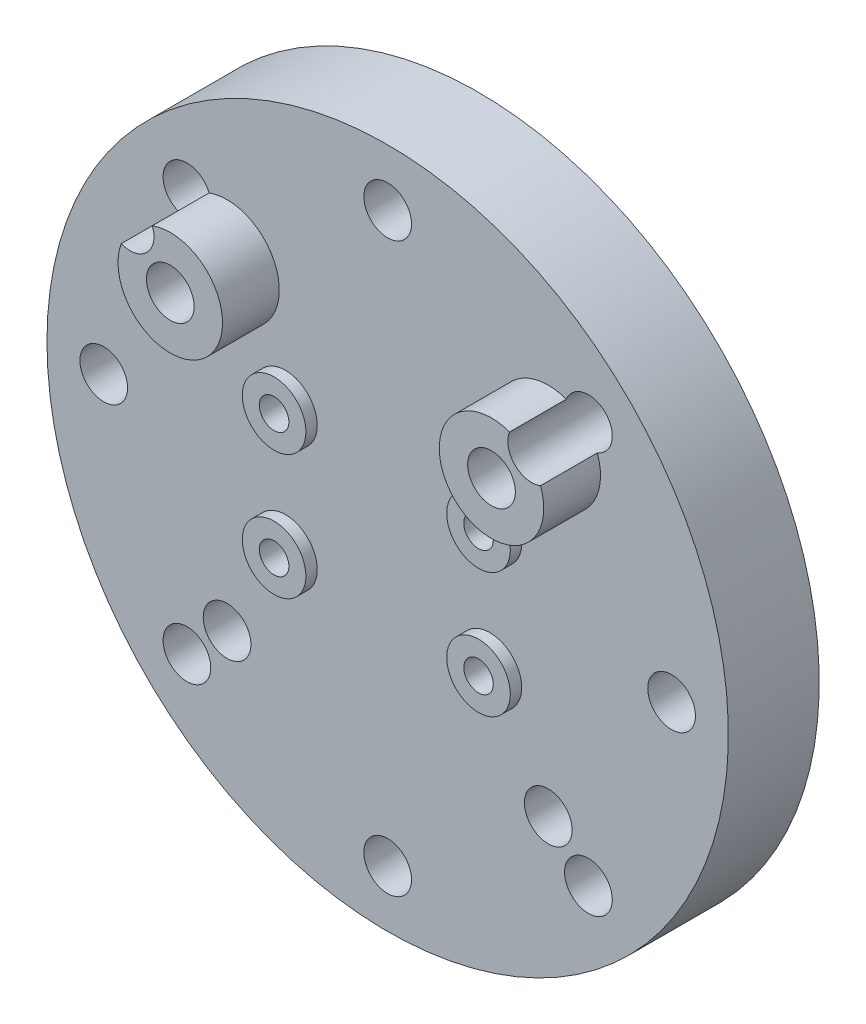
ISO-10303-21;
HEADER;
FILE_DESCRIPTION(('STEP AP214'),'2;1');
FILE_NAME('part.step','',(''),(''),'','','');
FILE_SCHEMA(('AUTOMOTIVE_DESIGN { 1 0 10303 214 1 1 1 1 }'));
ENDSEC;
DATA;
#1=APPLICATION_CONTEXT('core data for automotive mechanical design processes');
#2=APPLICATION_PROTOCOL_DEFINITION('international standard','automotive_design',2000,#1);
#3=PRODUCT_CONTEXT('',#1,'mechanical');
#4=PRODUCT('Part','Part','',(#3));
#5=PRODUCT_RELATED_PRODUCT_CATEGORY('part','',(#4));
#6=PRODUCT_DEFINITION_FORMATION('','',#4);
#7=PRODUCT_DEFINITION_CONTEXT('part definition',#1,'design');
#8=PRODUCT_DEFINITION('design','',#6,#7);
#9=PRODUCT_DEFINITION_SHAPE('','',#8);
#10=(LENGTH_UNIT() NAMED_UNIT(*) SI_UNIT(.MILLI.,.METRE.));
#11=(NAMED_UNIT(*) PLANE_ANGLE_UNIT() SI_UNIT($,.RADIAN.));
#12=(NAMED_UNIT(*) SI_UNIT($,.STERADIAN.) SOLID_ANGLE_UNIT());
#13=UNCERTAINTY_MEASURE_WITH_UNIT(LENGTH_MEASURE(1.E-05),#10,'distance_accuracy_value','');
#14=(GEOMETRIC_REPRESENTATION_CONTEXT(3) GLOBAL_UNCERTAINTY_ASSIGNED_CONTEXT((#13)) GLOBAL_UNIT_ASSIGNED_CONTEXT((#10,
#11,#12)) REPRESENTATION_CONTEXT('',''));
#15=CARTESIAN_POINT('',(0.,0.,0.));
#16=DIRECTION('',(0.,0.,1.));
#17=DIRECTION('',(1.,0.,0.));
#18=AXIS2_PLACEMENT_3D('',#15,#16,#17);
#19=CARTESIAN_POINT('',(-14.1421356237309,14.142135623731,2.));
#20=DIRECTION('',(0.,0.,-1.));
#21=DIRECTION('',(-1.,0.,0.));
#22=AXIS2_PLACEMENT_3D('',#19,#20,#21);
#23=CYLINDRICAL_SURFACE('',#22,2.1);
#24=CARTESIAN_POINT('',(-14.1421356237309,14.142135623731,7.));
#25=DIRECTION('',(0.,0.,1.));
#26=DIRECTION('',(1.,0.,0.));
#27=AXIS2_PLACEMENT_3D('',#24,#25,#26);
#28=CIRCLE('',#27,2.1);
#29=CARTESIAN_POINT('',(-12.0421356237309,14.142135623731,7.));
#30=VERTEX_POINT('',#29);
#31=EDGE_CURVE('E227',#30,#30,#28,.T.);
#32=ORIENTED_EDGE('',*,*,#31,.T.);
#33=EDGE_LOOP('',(#32));
#34=FACE_BOUND('',#33,.T.);
#35=CARTESIAN_POINT('',(-14.1421356237309,14.142135623731,-3.));
#36=DIRECTION('',(0.,0.,-1.));
#37=DIRECTION('',(-1.,0.,0.));
#38=AXIS2_PLACEMENT_3D('',#35,#36,#37);
#39=CIRCLE('',#38,2.1);
#40=CARTESIAN_POINT('',(-16.2421356237309,14.142135623731,-3.));
#41=VERTEX_POINT('',#40);
#42=EDGE_CURVE('E310',#41,#41,#39,.T.);
#43=ORIENTED_EDGE('',*,*,#42,.T.);
#44=EDGE_LOOP('',(#43));
#45=FACE_BOUND('',#44,.T.);
#46=ADVANCED_FACE('F34',(#34,#45),#23,.F.);
#47=CARTESIAN_POINT('',(14.142135623731,14.142135623731,2.));
#48=DIRECTION('',(0.,0.,-1.));
#49=DIRECTION('',(-1.,0.,0.));
#50=AXIS2_PLACEMENT_3D('',#47,#48,#49);
#51=CYLINDRICAL_SURFACE('',#50,2.1);
#52=CARTESIAN_POINT('',(14.142135623731,14.142135623731,7.));
#53=DIRECTION('',(0.,0.,1.));
#54=DIRECTION('',(1.,0.,0.));
#55=AXIS2_PLACEMENT_3D('',#52,#53,#54);
#56=CIRCLE('',#55,2.1);
#57=CARTESIAN_POINT('',(16.242135623731,14.142135623731,7.));
#58=VERTEX_POINT('',#57);
#59=EDGE_CURVE('E233',#58,#58,#56,.T.);
#60=ORIENTED_EDGE('',*,*,#59,.T.);
#61=EDGE_LOOP('',(#60));
#62=FACE_BOUND('',#61,.T.);
#63=CARTESIAN_POINT('',(14.142135623731,14.142135623731,-3.));
#64=DIRECTION('',(0.,0.,-1.));
#65=DIRECTION('',(-1.,0.,0.));
#66=AXIS2_PLACEMENT_3D('',#63,#64,#65);
#67=CIRCLE('',#66,2.1);
#68=CARTESIAN_POINT('',(12.042135623731,14.142135623731,-3.));
#69=VERTEX_POINT('',#68);
#70=EDGE_CURVE('E135',#69,#69,#67,.T.);
#71=ORIENTED_EDGE('',*,*,#70,.T.);
#72=EDGE_LOOP('',(#71));
#73=FACE_BOUND('',#72,.T.);
#74=ADVANCED_FACE('F377',(#62,#73),#51,.F.);
#75=CARTESIAN_POINT('',(-14.142135623731,-14.1421356237309,7.));
#76=DIRECTION('',(0.,0.,-1.));
#77=DIRECTION('',(-1.,0.,0.));
#78=AXIS2_PLACEMENT_3D('',#75,#76,#77);
#79=CYLINDRICAL_SURFACE('',#78,2.1);
#80=CARTESIAN_POINT('',(-14.142135623731,-14.1421356237309,2.));
#81=DIRECTION('',(0.,0.,1.));
#82=DIRECTION('',(1.,0.,0.));
#83=AXIS2_PLACEMENT_3D('',#80,#81,#82);
#84=CIRCLE('',#83,2.1);
#85=CARTESIAN_POINT('',(-12.042135623731,-14.1421356237309,2.));
#86=VERTEX_POINT('',#85);
#87=EDGE_CURVE('E183',#86,#86,#84,.T.);
#88=ORIENTED_EDGE('',*,*,#87,.T.);
#89=EDGE_LOOP('',(#88));
#90=FACE_BOUND('',#89,.T.);
#91=CARTESIAN_POINT('',(-14.142135623731,-14.1421356237309,-3.));
#92=DIRECTION('',(0.,0.,-1.));
#93=DIRECTION('',(-1.,0.,0.));
#94=AXIS2_PLACEMENT_3D('',#91,#92,#93);
#95=CIRCLE('',#94,2.1);
#96=CARTESIAN_POINT('',(-16.242135623731,-14.1421356237309,-3.));
#97=VERTEX_POINT('',#96);
#98=EDGE_CURVE('E312',#97,#97,#95,.T.);
#99=ORIENTED_EDGE('',*,*,#98,.T.);
#100=EDGE_LOOP('',(#99));
#101=FACE_BOUND('',#100,.T.);
#102=ADVANCED_FACE('F383',(#90,#101),#79,.F.);
#103=CARTESIAN_POINT('',(14.142135623731,-14.1421356237309,7.));
#104=DIRECTION('',(0.,0.,-1.));
#105=DIRECTION('',(-1.,0.,0.));
#106=AXIS2_PLACEMENT_3D('',#103,#104,#105);
#107=CYLINDRICAL_SURFACE('',#106,2.1);
#108=CARTESIAN_POINT('',(14.142135623731,-14.1421356237309,2.));
#109=DIRECTION('',(0.,0.,1.));
#110=DIRECTION('',(1.,0.,0.));
#111=AXIS2_PLACEMENT_3D('',#108,#109,#110);
#112=CIRCLE('',#111,2.1);
#113=CARTESIAN_POINT('',(16.242135623731,-14.1421356237309,2.));
#114=VERTEX_POINT('',#113);
#115=EDGE_CURVE('E206',#114,#114,#112,.T.);
#116=ORIENTED_EDGE('',*,*,#115,.T.);
#117=EDGE_LOOP('',(#116));
#118=FACE_BOUND('',#117,.T.);
#119=CARTESIAN_POINT('',(14.142135623731,-14.1421356237309,-3.));
#120=DIRECTION('',(0.,0.,-1.));
#121=DIRECTION('',(-1.,0.,0.));
#122=AXIS2_PLACEMENT_3D('',#119,#120,#121);
#123=CIRCLE('',#122,2.1);
#124=CARTESIAN_POINT('',(12.042135623731,-14.1421356237309,-3.));
#125=VERTEX_POINT('',#124);
#126=EDGE_CURVE('E320',#125,#125,#123,.T.);
#127=ORIENTED_EDGE('',*,*,#126,.T.);
#128=EDGE_LOOP('',(#127));
#129=FACE_BOUND('',#128,.T.);
#130=ADVANCED_FACE('F435',(#118,#129),#107,.F.);
#131=CARTESIAN_POINT('',(-14.1421356237309,14.142135623731,3.));
#132=DIRECTION('',(0.,0.,-1.));
#133=DIRECTION('',(-1.,0.,0.));
#134=AXIS2_PLACEMENT_3D('',#131,#132,#133);
#135=CYLINDRICAL_SURFACE('',#134,4.6);
#136=CARTESIAN_POINT('',(-14.1421356237309,14.142135623731,2.));
#137=DIRECTION('',(0.,0.,1.));
#138=DIRECTION('',(1.,0.,0.));
#139=AXIS2_PLACEMENT_3D('',#136,#137,#138);
#140=CIRCLE('',#139,4.6);
#141=CARTESIAN_POINT('',(-18.4598420443869,15.7287708259832,2.));
#142=VERTEX_POINT('',#141);
#143=CARTESIAN_POINT('',(-15.7287708259821,18.4598420443873,2.));
#144=VERTEX_POINT('',#143);
#145=EDGE_CURVE('E242',#142,#144,#140,.T.);
#146=ORIENTED_EDGE('',*,*,#145,.T.);
#147=DIRECTION('',(0.,0.,-1.));
#148=VECTOR('',#147,1.);
#149=CARTESIAN_POINT('',(-15.7287708259821,18.4598420443873,0.5));
#150=LINE('',#149,#148);
#151=CARTESIAN_POINT('',(-15.7287708259821,18.4598420443873,7.));
#152=VERTEX_POINT('',#151);
#153=EDGE_CURVE('E177',#144,#152,#150,.F.);
#154=ORIENTED_EDGE('',*,*,#153,.T.);
#155=CARTESIAN_POINT('',(-14.1421356237309,14.142135623731,7.));
#156=DIRECTION('',(0.,0.,1.));
#157=DIRECTION('',(1.,0.,0.));
#158=AXIS2_PLACEMENT_3D('',#155,#156,#157);
#159=CIRCLE('',#158,4.6);
#160=CARTESIAN_POINT('',(-18.4598420443869,15.7287708259832,7.));
#161=VERTEX_POINT('',#160);
#162=EDGE_CURVE('E230',#161,#152,#159,.T.);
#163=ORIENTED_EDGE('',*,*,#162,.F.);
#164=DIRECTION('',(0.,0.,-1.));
#165=VECTOR('',#164,1.);
#166=CARTESIAN_POINT('',(-18.4598420443869,15.7287708259832,0.5));
#167=LINE('',#166,#165);
#168=EDGE_CURVE('E174',#161,#142,#167,.T.);
#169=ORIENTED_EDGE('',*,*,#168,.T.);
#170=EDGE_LOOP('',(#146,#154,#163,#169));
#171=FACE_BOUND('',#170,.T.);
#172=ADVANCED_FACE('F430',(#171),#135,.T.);
#173=CARTESIAN_POINT('',(14.142135623731,14.142135623731,3.));
#174=DIRECTION('',(0.,0.,-1.));
#175=DIRECTION('',(-1.,0.,0.));
#176=AXIS2_PLACEMENT_3D('',#173,#174,#175);
#177=CYLINDRICAL_SURFACE('',#176,4.6);
#178=CARTESIAN_POINT('',(14.142135623731,14.142135623731,2.));
#179=DIRECTION('',(0.,0.,1.));
#180=DIRECTION('',(1.,0.,0.));
#181=AXIS2_PLACEMENT_3D('',#178,#179,#180);
#182=CIRCLE('',#181,4.6);
#183=CARTESIAN_POINT('',(15.728770825981,18.4598420443877,2.));
#184=VERTEX_POINT('',#183);
#185=CARTESIAN_POINT('',(18.4598420443881,15.72877082598,2.));
#186=VERTEX_POINT('',#185);
#187=EDGE_CURVE('E239',#184,#186,#182,.T.);
#188=ORIENTED_EDGE('',*,*,#187,.T.);
#189=DIRECTION('',(0.,0.,-1.));
#190=VECTOR('',#189,1.);
#191=CARTESIAN_POINT('',(18.4598420443881,15.72877082598,0.5));
#192=LINE('',#191,#190);
#193=CARTESIAN_POINT('',(18.4598420443881,15.72877082598,7.));
#194=VERTEX_POINT('',#193);
#195=EDGE_CURVE('E203',#186,#194,#192,.F.);
#196=ORIENTED_EDGE('',*,*,#195,.T.);
#197=CARTESIAN_POINT('',(14.142135623731,14.142135623731,7.));
#198=DIRECTION('',(0.,0.,1.));
#199=DIRECTION('',(1.,0.,0.));
#200=AXIS2_PLACEMENT_3D('',#197,#198,#199);
#201=CIRCLE('',#200,4.6);
#202=CARTESIAN_POINT('',(15.728770825981,18.4598420443877,7.));
#203=VERTEX_POINT('',#202);
#204=EDGE_CURVE('E236',#203,#194,#201,.T.);
#205=ORIENTED_EDGE('',*,*,#204,.F.);
#206=DIRECTION('',(0.,0.,-1.));
#207=VECTOR('',#206,1.);
#208=CARTESIAN_POINT('',(15.728770825981,18.4598420443877,0.5));
#209=LINE('',#208,#207);
#210=EDGE_CURVE('E200',#203,#184,#209,.T.);
#211=ORIENTED_EDGE('',*,*,#210,.T.);
#212=EDGE_LOOP('',(#188,#196,#205,#211));
#213=FACE_BOUND('',#212,.T.);
#214=ADVANCED_FACE('F434',(#213),#177,.T.);
#215=CARTESIAN_POINT('',(0.,0.,2.));
#216=DIRECTION('',(0.,0.,1.));
#217=DIRECTION('',(1.,0.,0.));
#218=AXIS2_PLACEMENT_3D('',#215,#216,#217);
#219=PLANE('',#218);
#220=CARTESIAN_POINT('',(17.6776695296631,17.6776695296622,2.));
#221=DIRECTION('',(0.,0.,1.));
#222=DIRECTION('',(1.,0.,0.));
#223=AXIS2_PLACEMENT_3D('',#220,#221,#222);
#224=CIRCLE('',#223,2.10000000000133);
#225=EDGE_CURVE('E198',#186,#184,#224,.T.);
#226=ORIENTED_EDGE('',*,*,#225,.F.);
#227=ORIENTED_EDGE('',*,*,#187,.F.);
#228=EDGE_LOOP('',(#226,#227));
#229=FACE_BOUND('',#228,.T.);
#230=CARTESIAN_POINT('',(24.9999999999979,-2.1316282072803E-12,2.));
#231=DIRECTION('',(0.,0.,1.));
#232=DIRECTION('',(1.,0.,0.));
#233=AXIS2_PLACEMENT_3D('',#230,#231,#232);
#234=CIRCLE('',#233,2.10000000000291);
#235=CARTESIAN_POINT('',(27.1000000000008,-2.1316282072803E-12,2.));
#236=VERTEX_POINT('',#235);
#237=EDGE_CURVE('E195',#236,#236,#234,.T.);
#238=ORIENTED_EDGE('',*,*,#237,.F.);
#239=EDGE_LOOP('',(#238));
#240=FACE_BOUND('',#239,.T.);
#241=CARTESIAN_POINT('',(17.6776695296601,-17.6776695296652,2.));
#242=DIRECTION('',(0.,0.,1.));
#243=DIRECTION('',(1.,0.,0.));
#244=AXIS2_PLACEMENT_3D('',#241,#242,#243);
#245=CIRCLE('',#244,2.10000000000413);
#246=CARTESIAN_POINT('',(19.7776695296642,-17.6776695296652,2.));
#247=VERTEX_POINT('',#246);
#248=EDGE_CURVE('E192',#247,#247,#245,.T.);
#249=ORIENTED_EDGE('',*,*,#248,.F.);
#250=EDGE_LOOP('',(#249));
#251=FACE_BOUND('',#250,.T.);
#252=CARTESIAN_POINT('',(-4.25713318056486E-12,-25.,2.));
#253=DIRECTION('',(0.,0.,1.));
#254=DIRECTION('',(1.,0.,0.));
#255=AXIS2_PLACEMENT_3D('',#252,#253,#254);
#256=CIRCLE('',#255,2.10000000000424);
#257=CARTESIAN_POINT('',(2.09999999999998,-25.,2.));
#258=VERTEX_POINT('',#257);
#259=EDGE_CURVE('E189',#258,#258,#256,.T.);
#260=ORIENTED_EDGE('',*,*,#259,.F.);
#261=EDGE_LOOP('',(#260));
#262=FACE_BOUND('',#261,.T.);
#263=CARTESIAN_POINT('',(-17.6776695296673,-17.6776695296622,2.));
#264=DIRECTION('',(0.,0.,1.));
#265=DIRECTION('',(1.,0.,0.));
#266=AXIS2_PLACEMENT_3D('',#263,#264,#265);
#267=CIRCLE('',#266,2.10000000000317);
#268=CARTESIAN_POINT('',(-15.5776695296642,-17.6776695296622,2.));
#269=VERTEX_POINT('',#268);
#270=EDGE_CURVE('E186',#269,#269,#267,.T.);
#271=ORIENTED_EDGE('',*,*,#270,.F.);
#272=EDGE_LOOP('',(#271));
#273=FACE_BOUND('',#272,.T.);
#274=ORIENTED_EDGE('',*,*,#87,.F.);
#275=EDGE_LOOP('',(#274));
#276=FACE_BOUND('',#275,.T.);
#277=CARTESIAN_POINT('',(0.,25.,2.));
#278=DIRECTION('',(0.,0.,1.));
#279=DIRECTION('',(1.,0.,0.));
#280=AXIS2_PLACEMENT_3D('',#277,#278,#279);
#281=CIRCLE('',#280,2.1);
#282=CARTESIAN_POINT('',(2.1,25.,2.));
#283=VERTEX_POINT('',#282);
#284=EDGE_CURVE('E180',#283,#283,#281,.T.);
#285=ORIENTED_EDGE('',*,*,#284,.F.);
#286=EDGE_LOOP('',(#285));
#287=FACE_BOUND('',#286,.T.);
#288=CARTESIAN_POINT('',(-17.6776695296643,17.6776695296652,2.));
#289=DIRECTION('',(0.,0.,1.));
#290=DIRECTION('',(1.,0.,0.));
#291=AXIS2_PLACEMENT_3D('',#288,#289,#290);
#292=CIRCLE('',#291,2.1000000000002);
#293=EDGE_CURVE('E172',#144,#142,#292,.T.);
#294=ORIENTED_EDGE('',*,*,#293,.F.);
#295=ORIENTED_EDGE('',*,*,#145,.F.);
#296=EDGE_LOOP('',(#294,#295));
#297=FACE_BOUND('',#296,.T.);
#298=CARTESIAN_POINT('',(-25.0000000000021,2.12856659028243E-12,2.));
#299=DIRECTION('',(0.,0.,1.));
#300=DIRECTION('',(1.,0.,0.));
#301=AXIS2_PLACEMENT_3D('',#298,#299,#300);
#302=CIRCLE('',#301,2.1000000000015);
#303=CARTESIAN_POINT('',(-22.9000000000006,2.12856659028243E-12,2.));
#304=VERTEX_POINT('',#303);
#305=EDGE_CURVE('E169',#304,#304,#302,.T.);
#306=ORIENTED_EDGE('',*,*,#305,.F.);
#307=EDGE_LOOP('',(#306));
#308=FACE_BOUND('',#307,.T.);
#309=ORIENTED_EDGE('',*,*,#115,.F.);
#310=EDGE_LOOP('',(#309));
#311=FACE_BOUND('',#310,.T.);
#312=CARTESIAN_POINT('',(-9.,5.5,2.));
#313=DIRECTION('',(0.,0.,1.));
#314=DIRECTION('',(1.,0.,0.));
#315=AXIS2_PLACEMENT_3D('',#312,#313,#314);
#316=CIRCLE('',#315,2.8);
#317=CARTESIAN_POINT('',(-6.2,5.5,2.));
#318=VERTEX_POINT('',#317);
#319=EDGE_CURVE('E248',#318,#318,#316,.T.);
#320=ORIENTED_EDGE('',*,*,#319,.F.);
#321=EDGE_LOOP('',(#320));
#322=FACE_BOUND('',#321,.T.);
#323=CARTESIAN_POINT('',(9.,-5.5,2.));
#324=DIRECTION('',(0.,0.,1.));
#325=DIRECTION('',(1.,0.,0.));
#326=AXIS2_PLACEMENT_3D('',#323,#324,#325);
#327=CIRCLE('',#326,2.8);
#328=CARTESIAN_POINT('',(11.8,-5.5,2.));
#329=VERTEX_POINT('',#328);
#330=EDGE_CURVE('E266',#329,#329,#327,.T.);
#331=ORIENTED_EDGE('',*,*,#330,.F.);
#332=EDGE_LOOP('',(#331));
#333=FACE_BOUND('',#332,.T.);
#334=CARTESIAN_POINT('',(-9.,-5.5,2.));
#335=DIRECTION('',(0.,0.,1.));
#336=DIRECTION('',(1.,0.,0.));
#337=AXIS2_PLACEMENT_3D('',#334,#335,#336);
#338=CIRCLE('',#337,2.8);
#339=CARTESIAN_POINT('',(-6.2,-5.5,2.));
#340=VERTEX_POINT('',#339);
#341=EDGE_CURVE('E275',#340,#340,#338,.T.);
#342=ORIENTED_EDGE('',*,*,#341,.F.);
#343=EDGE_LOOP('',(#342));
#344=FACE_BOUND('',#343,.T.);
#345=CARTESIAN_POINT('',(9.,5.5,2.));
#346=DIRECTION('',(0.,0.,1.));
#347=DIRECTION('',(1.,0.,0.));
#348=AXIS2_PLACEMENT_3D('',#345,#346,#347);
#349=CIRCLE('',#348,2.8);
#350=CARTESIAN_POINT('',(11.8,5.5,2.));
#351=VERTEX_POINT('',#350);
#352=EDGE_CURVE('E257',#351,#351,#349,.T.);
#353=ORIENTED_EDGE('',*,*,#352,.F.);
#354=EDGE_LOOP('',(#353));
#355=FACE_BOUND('',#354,.T.);
#356=CARTESIAN_POINT('',(0.,0.,2.));
#357=DIRECTION('',(0.,0.,-1.));
#358=DIRECTION('',(-1.,0.,0.));
#359=AXIS2_PLACEMENT_3D('',#356,#357,#358);
#360=CIRCLE('',#359,30.);
#361=CARTESIAN_POINT('',(-30.,0.,2.));
#362=VERTEX_POINT('',#361);
#363=EDGE_CURVE('E209',#362,#362,#360,.T.);
#364=ORIENTED_EDGE('',*,*,#363,.F.);
#365=EDGE_LOOP('',(#364));
#366=FACE_BOUND('',#365,.T.);
#367=ADVANCED_FACE('F36',(#229,#240,#251,#262,#273,#276,#287,#297,#308,#311,#322,#333,#344,#355,
#366),#219,.T.);
#368=CARTESIAN_POINT('',(-9.,5.5,2.));
#369=DIRECTION('',(0.,0.,-1.));
#370=DIRECTION('',(-1.,0.,0.));
#371=AXIS2_PLACEMENT_3D('',#368,#369,#370);
#372=CYLINDRICAL_SURFACE('',#371,1.3);
#373=CARTESIAN_POINT('',(-9.,5.5,3.));
#374=DIRECTION('',(0.,0.,1.));
#375=DIRECTION('',(1.,0.,0.));
#376=AXIS2_PLACEMENT_3D('',#373,#374,#375);
#377=CIRCLE('',#376,1.3);
#378=CARTESIAN_POINT('',(-7.7,5.5,3.));
#379=VERTEX_POINT('',#378);
#380=EDGE_CURVE('E245',#379,#379,#377,.T.);
#381=ORIENTED_EDGE('',*,*,#380,.T.);
#382=EDGE_LOOP('',(#381));
#383=FACE_BOUND('',#382,.T.);
#384=CARTESIAN_POINT('',(-9.,5.5,-6.));
#385=DIRECTION('',(0.,0.,-1.));
#386=DIRECTION('',(-1.,0.,0.));
#387=AXIS2_PLACEMENT_3D('',#384,#385,#386);
#388=CIRCLE('',#387,1.3);
#389=CARTESIAN_POINT('',(-10.3,5.5,-6.));
#390=VERTEX_POINT('',#389);
#391=EDGE_CURVE('E221',#390,#390,#388,.T.);
#392=ORIENTED_EDGE('',*,*,#391,.T.);
#393=EDGE_LOOP('',(#392));
#394=FACE_BOUND('',#393,.T.);
#395=ADVANCED_FACE('F388',(#383,#394),#372,.F.);
#396=CARTESIAN_POINT('',(-9.,-5.5,2.));
#397=DIRECTION('',(0.,0.,-1.));
#398=DIRECTION('',(-1.,0.,0.));
#399=AXIS2_PLACEMENT_3D('',#396,#397,#398);
#400=CYLINDRICAL_SURFACE('',#399,1.3);
#401=CARTESIAN_POINT('',(-9.,-5.5,3.));
#402=DIRECTION('',(0.,0.,1.));
#403=DIRECTION('',(1.,0.,0.));
#404=AXIS2_PLACEMENT_3D('',#401,#402,#403);
#405=CIRCLE('',#404,1.3);
#406=CARTESIAN_POINT('',(-7.7,-5.5,3.));
#407=VERTEX_POINT('',#406);
#408=EDGE_CURVE('E270',#407,#407,#405,.T.);
#409=ORIENTED_EDGE('',*,*,#408,.T.);
#410=EDGE_LOOP('',(#409));
#411=FACE_BOUND('',#410,.T.);
#412=CARTESIAN_POINT('',(-9.,-5.5,-6.));
#413=DIRECTION('',(0.,0.,-1.));
#414=DIRECTION('',(-1.,0.,0.));
#415=AXIS2_PLACEMENT_3D('',#412,#413,#414);
#416=CIRCLE('',#415,1.3);
#417=CARTESIAN_POINT('',(-10.3,-5.5,-6.));
#418=VERTEX_POINT('',#417);
#419=EDGE_CURVE('E218',#418,#418,#416,.T.);
#420=ORIENTED_EDGE('',*,*,#419,.T.);
#421=EDGE_LOOP('',(#420));
#422=FACE_BOUND('',#421,.T.);
#423=ADVANCED_FACE('F372',(#411,#422),#400,.F.);
#424=CARTESIAN_POINT('',(9.,5.5,2.));
#425=DIRECTION('',(0.,0.,-1.));
#426=DIRECTION('',(-1.,0.,0.));
#427=AXIS2_PLACEMENT_3D('',#424,#425,#426);
#428=CYLINDRICAL_SURFACE('',#427,1.3);
#429=CARTESIAN_POINT('',(9.,5.5,3.));
#430=DIRECTION('',(0.,0.,1.));
#431=DIRECTION('',(1.,0.,0.));
#432=AXIS2_PLACEMENT_3D('',#429,#430,#431);
#433=CIRCLE('',#432,1.3);
#434=CARTESIAN_POINT('',(10.3,5.5,3.));
#435=VERTEX_POINT('',#434);
#436=EDGE_CURVE('E252',#435,#435,#433,.T.);
#437=ORIENTED_EDGE('',*,*,#436,.T.);
#438=EDGE_LOOP('',(#437));
#439=FACE_BOUND('',#438,.T.);
#440=CARTESIAN_POINT('',(9.,5.5,-6.));
#441=DIRECTION('',(0.,0.,-1.));
#442=DIRECTION('',(-1.,0.,0.));
#443=AXIS2_PLACEMENT_3D('',#440,#441,#442);
#444=CIRCLE('',#443,1.3);
#445=CARTESIAN_POINT('',(7.7,5.5,-6.));
#446=VERTEX_POINT('',#445);
#447=EDGE_CURVE('E212',#446,#446,#444,.T.);
#448=ORIENTED_EDGE('',*,*,#447,.T.);
#449=EDGE_LOOP('',(#448));
#450=FACE_BOUND('',#449,.T.);
#451=ADVANCED_FACE('F361',(#439,#450),#428,.F.);
#452=CARTESIAN_POINT('',(9.,-5.5,2.));
#453=DIRECTION('',(0.,0.,-1.));
#454=DIRECTION('',(-1.,0.,0.));
#455=AXIS2_PLACEMENT_3D('',#452,#453,#454);
#456=CYLINDRICAL_SURFACE('',#455,1.3);
#457=CARTESIAN_POINT('',(9.,-5.5,3.));
#458=DIRECTION('',(0.,0.,1.));
#459=DIRECTION('',(1.,0.,0.));
#460=AXIS2_PLACEMENT_3D('',#457,#458,#459);
#461=CIRCLE('',#460,1.3);
#462=CARTESIAN_POINT('',(10.3,-5.5,3.));
#463=VERTEX_POINT('',#462);
#464=EDGE_CURVE('E261',#463,#463,#461,.T.);
#465=ORIENTED_EDGE('',*,*,#464,.T.);
#466=EDGE_LOOP('',(#465));
#467=FACE_BOUND('',#466,.T.);
#468=CARTESIAN_POINT('',(9.,-5.5,-6.));
#469=DIRECTION('',(0.,0.,-1.));
#470=DIRECTION('',(-1.,0.,0.));
#471=AXIS2_PLACEMENT_3D('',#468,#469,#470);
#472=CIRCLE('',#471,1.3);
#473=CARTESIAN_POINT('',(7.7,-5.5,-6.));
#474=VERTEX_POINT('',#473);
#475=EDGE_CURVE('E215',#474,#474,#472,.T.);
#476=ORIENTED_EDGE('',*,*,#475,.T.);
#477=EDGE_LOOP('',(#476));
#478=FACE_BOUND('',#477,.T.);
#479=ADVANCED_FACE('F358',(#467,#478),#456,.F.);
#480=CARTESIAN_POINT('',(-9.,-5.5,3.));
#481=DIRECTION('',(0.,0.,1.));
#482=DIRECTION('',(1.,0.,0.));
#483=AXIS2_PLACEMENT_3D('',#480,#481,#482);
#484=PLANE('',#483);
#485=CARTESIAN_POINT('',(-9.,-5.5,3.));
#486=DIRECTION('',(0.,0.,1.));
#487=DIRECTION('',(1.,0.,0.));
#488=AXIS2_PLACEMENT_3D('',#485,#486,#487);
#489=CIRCLE('',#488,2.8);
#490=CARTESIAN_POINT('',(-6.2,-5.5,3.));
#491=VERTEX_POINT('',#490);
#492=EDGE_CURVE('E276',#491,#491,#489,.T.);
#493=ORIENTED_EDGE('',*,*,#492,.T.);
#494=EDGE_LOOP('',(#493));
#495=FACE_BOUND('',#494,.T.);
#496=ORIENTED_EDGE('',*,*,#408,.F.);
#497=EDGE_LOOP('',(#496));
#498=FACE_BOUND('',#497,.T.);
#499=ADVANCED_FACE('F360',(#495,#498),#484,.T.);
#500=CARTESIAN_POINT('',(-9.,-5.5,3.));
#501=DIRECTION('',(0.,0.,-1.));
#502=DIRECTION('',(-1.,0.,0.));
#503=AXIS2_PLACEMENT_3D('',#500,#501,#502);
#504=CYLINDRICAL_SURFACE('',#503,2.8);
#505=ORIENTED_EDGE('',*,*,#492,.F.);
#506=EDGE_LOOP('',(#505));
#507=FACE_BOUND('',#506,.T.);
#508=ORIENTED_EDGE('',*,*,#341,.T.);
#509=EDGE_LOOP('',(#508));
#510=FACE_BOUND('',#509,.T.);
#511=ADVANCED_FACE('F369',(#507,#510),#504,.T.);
#512=CARTESIAN_POINT('',(9.,-5.5,3.));
#513=DIRECTION('',(0.,0.,1.));
#514=DIRECTION('',(1.,0.,0.));
#515=AXIS2_PLACEMENT_3D('',#512,#513,#514);
#516=PLANE('',#515);
#517=CARTESIAN_POINT('',(9.,-5.5,3.));
#518=DIRECTION('',(0.,0.,1.));
#519=DIRECTION('',(1.,0.,0.));
#520=AXIS2_PLACEMENT_3D('',#517,#518,#519);
#521=CIRCLE('',#520,2.8);
#522=CARTESIAN_POINT('',(11.8,-5.5,3.));
#523=VERTEX_POINT('',#522);
#524=EDGE_CURVE('E267',#523,#523,#521,.T.);
#525=ORIENTED_EDGE('',*,*,#524,.T.);
#526=EDGE_LOOP('',(#525));
#527=FACE_BOUND('',#526,.T.);
#528=ORIENTED_EDGE('',*,*,#464,.F.);
#529=EDGE_LOOP('',(#528));
#530=FACE_BOUND('',#529,.T.);
#531=ADVANCED_FACE('F666',(#527,#530),#516,.T.);
#532=CARTESIAN_POINT('',(9.,-5.5,3.));
#533=DIRECTION('',(0.,0.,-1.));
#534=DIRECTION('',(-1.,0.,0.));
#535=AXIS2_PLACEMENT_3D('',#532,#533,#534);
#536=CYLINDRICAL_SURFACE('',#535,2.8);
#537=ORIENTED_EDGE('',*,*,#524,.F.);
#538=EDGE_LOOP('',(#537));
#539=FACE_BOUND('',#538,.T.);
#540=ORIENTED_EDGE('',*,*,#330,.T.);
#541=EDGE_LOOP('',(#540));
#542=FACE_BOUND('',#541,.T.);
#543=ADVANCED_FACE('F661',(#539,#542),#536,.T.);
#544=CARTESIAN_POINT('',(9.,5.5,3.));
#545=DIRECTION('',(0.,0.,1.));
#546=DIRECTION('',(1.,0.,0.));
#547=AXIS2_PLACEMENT_3D('',#544,#545,#546);
#548=PLANE('',#547);
#549=CARTESIAN_POINT('',(9.,5.5,3.));
#550=DIRECTION('',(0.,0.,1.));
#551=DIRECTION('',(1.,0.,0.));
#552=AXIS2_PLACEMENT_3D('',#549,#550,#551);
#553=CIRCLE('',#552,2.8);
#554=CARTESIAN_POINT('',(11.8,5.5,3.));
#555=VERTEX_POINT('',#554);
#556=EDGE_CURVE('E258',#555,#555,#553,.T.);
#557=ORIENTED_EDGE('',*,*,#556,.T.);
#558=EDGE_LOOP('',(#557));
#559=FACE_BOUND('',#558,.T.);
#560=ORIENTED_EDGE('',*,*,#436,.F.);
#561=EDGE_LOOP('',(#560));
#562=FACE_BOUND('',#561,.T.);
#563=ADVANCED_FACE('F658',(#559,#562),#548,.T.);
#564=CARTESIAN_POINT('',(9.,5.5,3.));
#565=DIRECTION('',(0.,0.,-1.));
#566=DIRECTION('',(-1.,0.,0.));
#567=AXIS2_PLACEMENT_3D('',#564,#565,#566);
#568=CYLINDRICAL_SURFACE('',#567,2.8);
#569=ORIENTED_EDGE('',*,*,#556,.F.);
#570=EDGE_LOOP('',(#569));
#571=FACE_BOUND('',#570,.T.);
#572=ORIENTED_EDGE('',*,*,#352,.T.);
#573=EDGE_LOOP('',(#572));
#574=FACE_BOUND('',#573,.T.);
#575=ADVANCED_FACE('F654',(#571,#574),#568,.T.);
#576=CARTESIAN_POINT('',(-9.,5.5,3.));
#577=DIRECTION('',(0.,0.,1.));
#578=DIRECTION('',(1.,0.,0.));
#579=AXIS2_PLACEMENT_3D('',#576,#577,#578);
#580=PLANE('',#579);
#581=CARTESIAN_POINT('',(-9.,5.5,3.));
#582=DIRECTION('',(0.,0.,1.));
#583=DIRECTION('',(1.,0.,0.));
#584=AXIS2_PLACEMENT_3D('',#581,#582,#583);
#585=CIRCLE('',#584,2.8);
#586=CARTESIAN_POINT('',(-6.2,5.5,3.));
#587=VERTEX_POINT('',#586);
#588=EDGE_CURVE('E249',#587,#587,#585,.T.);
#589=ORIENTED_EDGE('',*,*,#588,.T.);
#590=EDGE_LOOP('',(#589));
#591=FACE_BOUND('',#590,.T.);
#592=ORIENTED_EDGE('',*,*,#380,.F.);
#593=EDGE_LOOP('',(#592));
#594=FACE_BOUND('',#593,.T.);
#595=ADVANCED_FACE('F651',(#591,#594),#580,.T.);
#596=CARTESIAN_POINT('',(-9.,5.5,3.));
#597=DIRECTION('',(0.,0.,-1.));
#598=DIRECTION('',(-1.,0.,0.));
#599=AXIS2_PLACEMENT_3D('',#596,#597,#598);
#600=CYLINDRICAL_SURFACE('',#599,2.8);
#601=ORIENTED_EDGE('',*,*,#588,.F.);
#602=EDGE_LOOP('',(#601));
#603=FACE_BOUND('',#602,.T.);
#604=ORIENTED_EDGE('',*,*,#319,.T.);
#605=EDGE_LOOP('',(#604));
#606=FACE_BOUND('',#605,.T.);
#607=ADVANCED_FACE('F464',(#603,#606),#600,.T.);
#608=CARTESIAN_POINT('',(14.142135623731,14.142135623731,7.));
#609=DIRECTION('',(0.,0.,1.));
#610=DIRECTION('',(1.,0.,0.));
#611=AXIS2_PLACEMENT_3D('',#608,#609,#610);
#612=PLANE('',#611);
#613=CARTESIAN_POINT('',(17.6776695296631,17.6776695296622,7.));
#614=DIRECTION('',(0.,0.,-1.));
#615=DIRECTION('',(-1.,0.,0.));
#616=AXIS2_PLACEMENT_3D('',#613,#614,#615);
#617=CIRCLE('',#616,2.10000000000133);
#618=EDGE_CURVE('E146',#194,#203,#617,.T.);
#619=ORIENTED_EDGE('',*,*,#618,.T.);
#620=ORIENTED_EDGE('',*,*,#204,.T.);
#621=EDGE_LOOP('',(#619,#620));
#622=FACE_BOUND('',#621,.T.);
#623=ORIENTED_EDGE('',*,*,#59,.F.);
#624=EDGE_LOOP('',(#623));
#625=FACE_BOUND('',#624,.T.);
#626=ADVANCED_FACE('F460',(#622,#625),#612,.T.);
#627=CARTESIAN_POINT('',(-14.1421356237309,14.142135623731,7.));
#628=DIRECTION('',(0.,0.,1.));
#629=DIRECTION('',(1.,0.,0.));
#630=AXIS2_PLACEMENT_3D('',#627,#628,#629);
#631=PLANE('',#630);
#632=CARTESIAN_POINT('',(-17.6776695296643,17.6776695296652,7.));
#633=DIRECTION('',(0.,0.,-1.));
#634=DIRECTION('',(-1.,0.,0.));
#635=AXIS2_PLACEMENT_3D('',#632,#633,#634);
#636=CIRCLE('',#635,2.1000000000002);
#637=EDGE_CURVE('E156',#152,#161,#636,.T.);
#638=ORIENTED_EDGE('',*,*,#637,.T.);
#639=ORIENTED_EDGE('',*,*,#162,.T.);
#640=EDGE_LOOP('',(#638,#639));
#641=FACE_BOUND('',#640,.T.);
#642=ORIENTED_EDGE('',*,*,#31,.F.);
#643=EDGE_LOOP('',(#642));
#644=FACE_BOUND('',#643,.T.);
#645=ADVANCED_FACE('F339',(#641,#644),#631,.T.);
#646=CARTESIAN_POINT('',(0.,0.,-6.));
#647=DIRECTION('',(0.,0.,-1.));
#648=DIRECTION('',(-1.,0.,0.));
#649=AXIS2_PLACEMENT_3D('',#646,#647,#648);
#650=PLANE('',#649);
#651=CARTESIAN_POINT('',(-14.142135623731,-14.1421356237309,-6.));
#652=DIRECTION('',(0.,0.,-1.));
#653=DIRECTION('',(-1.,0.,0.));
#654=AXIS2_PLACEMENT_3D('',#651,#652,#653);
#655=CIRCLE('',#654,3.6);
#656=CARTESIAN_POINT('',(-17.4375105642107,-15.5914471850105,-6.));
#657=VERTEX_POINT('',#656);
#658=CARTESIAN_POINT('',(-15.5914471850153,-17.4375105642085,-6.));
#659=VERTEX_POINT('',#658);
#660=EDGE_CURVE('E850',#657,#659,#655,.T.);
#661=ORIENTED_EDGE('',*,*,#660,.F.);
#662=CARTESIAN_POINT('',(-17.6776695296673,-17.6776695296622,-6.));
#663=DIRECTION('',(0.,0.,-1.));
#664=DIRECTION('',(-1.,0.,0.));
#665=AXIS2_PLACEMENT_3D('',#662,#663,#664);
#666=CIRCLE('',#665,2.10000000000317);
#667=EDGE_CURVE('E166',#659,#657,#666,.T.);
#668=ORIENTED_EDGE('',*,*,#667,.F.);
#669=EDGE_LOOP('',(#661,#668));
#670=FACE_BOUND('',#669,.T.);
#671=CARTESIAN_POINT('',(-14.1421356237309,14.142135623731,-6.));
#672=DIRECTION('',(0.,0.,-1.));
#673=DIRECTION('',(-1.,0.,0.));
#674=AXIS2_PLACEMENT_3D('',#671,#672,#673);
#675=CIRCLE('',#674,3.6);
#676=CARTESIAN_POINT('',(-15.5914471850156,17.4375105642084,-6.));
#677=VERTEX_POINT('',#676);
#678=CARTESIAN_POINT('',(-17.437510564208,15.5914471850164,-6.));
#679=VERTEX_POINT('',#678);
#680=EDGE_CURVE('E308',#677,#679,#675,.T.);
#681=ORIENTED_EDGE('',*,*,#680,.F.);
#682=CARTESIAN_POINT('',(-17.6776695296643,17.6776695296652,-6.));
#683=DIRECTION('',(0.,0.,-1.));
#684=DIRECTION('',(-1.,0.,0.));
#685=AXIS2_PLACEMENT_3D('',#682,#683,#684);
#686=CIRCLE('',#685,2.1000000000002);
#687=EDGE_CURVE('E160',#679,#677,#686,.T.);
#688=ORIENTED_EDGE('',*,*,#687,.F.);
#689=EDGE_LOOP('',(#681,#688));
#690=FACE_BOUND('',#689,.T.);
#691=CARTESIAN_POINT('',(14.142135623731,14.142135623731,-6.));
#692=DIRECTION('',(0.,0.,-1.));
#693=DIRECTION('',(-1.,0.,0.));
#694=AXIS2_PLACEMENT_3D('',#691,#692,#693);
#695=CIRCLE('',#694,3.6);
#696=CARTESIAN_POINT('',(17.43751056421,15.5914471850119,-6.));
#697=VERTEX_POINT('',#696);
#698=CARTESIAN_POINT('',(15.5914471850127,17.4375105642096,-6.));
#699=VERTEX_POINT('',#698);
#700=EDGE_CURVE('E123',#697,#699,#695,.T.);
#701=ORIENTED_EDGE('',*,*,#700,.F.);
#702=CARTESIAN_POINT('',(17.6776695296631,17.6776695296622,-6.));
#703=DIRECTION('',(0.,0.,-1.));
#704=DIRECTION('',(-1.,0.,0.));
#705=AXIS2_PLACEMENT_3D('',#702,#703,#704);
#706=CIRCLE('',#705,2.10000000000133);
#707=EDGE_CURVE('E140',#699,#697,#706,.T.);
#708=ORIENTED_EDGE('',*,*,#707,.F.);
#709=EDGE_LOOP('',(#701,#708));
#710=FACE_BOUND('',#709,.T.);
#711=CARTESIAN_POINT('',(14.142135623731,-14.1421356237309,-6.));
#712=DIRECTION('',(0.,0.,-1.));
#713=DIRECTION('',(-1.,0.,0.));
#714=AXIS2_PLACEMENT_3D('',#711,#712,#713);
#715=CIRCLE('',#714,3.6);
#716=CARTESIAN_POINT('',(15.591447185007,-17.4375105642122,-6.));
#717=VERTEX_POINT('',#716);
#718=CARTESIAN_POINT('',(17.4375105642101,-15.5914471850118,-6.));
#719=VERTEX_POINT('',#718);
#720=EDGE_CURVE('E152',#717,#719,#715,.T.);
#721=ORIENTED_EDGE('',*,*,#720,.F.);
#722=CARTESIAN_POINT('',(17.6776695296601,-17.6776695296652,-6.));
#723=DIRECTION('',(0.,0.,-1.));
#724=DIRECTION('',(-1.,0.,0.));
#725=AXIS2_PLACEMENT_3D('',#722,#723,#724);
#726=CIRCLE('',#725,2.10000000000413);
#727=EDGE_CURVE('E329',#719,#717,#726,.T.);
#728=ORIENTED_EDGE('',*,*,#727,.F.);
#729=EDGE_LOOP('',(#721,#728));
#730=FACE_BOUND('',#729,.T.);
#731=CARTESIAN_POINT('',(24.9999999999979,-2.1316282072803E-12,-6.));
#732=DIRECTION('',(0.,0.,-1.));
#733=DIRECTION('',(-1.,0.,0.));
#734=AXIS2_PLACEMENT_3D('',#731,#732,#733);
#735=CIRCLE('',#734,2.10000000000291);
#736=CARTESIAN_POINT('',(22.899999999995,-2.1316282072803E-12,-6.));
#737=VERTEX_POINT('',#736);
#738=EDGE_CURVE('E150',#737,#737,#735,.T.);
#739=ORIENTED_EDGE('',*,*,#738,.F.);
#740=EDGE_LOOP('',(#739));
#741=FACE_BOUND('',#740,.T.);
#742=CARTESIAN_POINT('',(-4.25713318056486E-12,-25.,-6.));
#743=DIRECTION('',(0.,0.,-1.));
#744=DIRECTION('',(-1.,0.,0.));
#745=AXIS2_PLACEMENT_3D('',#742,#743,#744);
#746=CIRCLE('',#745,2.10000000000424);
#747=CARTESIAN_POINT('',(-2.1000000000085,-25.,-6.));
#748=VERTEX_POINT('',#747);
#749=EDGE_CURVE('E326',#748,#748,#746,.T.);
#750=ORIENTED_EDGE('',*,*,#749,.F.);
#751=EDGE_LOOP('',(#750));
#752=FACE_BOUND('',#751,.T.);
#753=CARTESIAN_POINT('',(0.,25.,-6.));
#754=DIRECTION('',(0.,0.,-1.));
#755=DIRECTION('',(-1.,0.,0.));
#756=AXIS2_PLACEMENT_3D('',#753,#754,#755);
#757=CIRCLE('',#756,2.1);
#758=CARTESIAN_POINT('',(-2.1,25.,-6.));
#759=VERTEX_POINT('',#758);
#760=EDGE_CURVE('E159',#759,#759,#757,.T.);
#761=ORIENTED_EDGE('',*,*,#760,.F.);
#762=EDGE_LOOP('',(#761));
#763=FACE_BOUND('',#762,.T.);
#764=CARTESIAN_POINT('',(-25.0000000000021,2.12856659028243E-12,-6.));
#765=DIRECTION('',(0.,0.,-1.));
#766=DIRECTION('',(-1.,0.,0.));
#767=AXIS2_PLACEMENT_3D('',#764,#765,#766);
#768=CIRCLE('',#767,2.1000000000015);
#769=CARTESIAN_POINT('',(-27.1000000000036,2.12856659028243E-12,-6.));
#770=VERTEX_POINT('',#769);
#771=EDGE_CURVE('E163',#770,#770,#768,.T.);
#772=ORIENTED_EDGE('',*,*,#771,.F.);
#773=EDGE_LOOP('',(#772));
#774=FACE_BOUND('',#773,.T.);
#775=ORIENTED_EDGE('',*,*,#447,.F.);
#776=EDGE_LOOP('',(#775));
#777=FACE_BOUND('',#776,.T.);
#778=ORIENTED_EDGE('',*,*,#419,.F.);
#779=EDGE_LOOP('',(#778));
#780=FACE_BOUND('',#779,.T.);
#781=CARTESIAN_POINT('',(0.,0.,-6.));
#782=DIRECTION('',(0.,0.,-1.));
#783=DIRECTION('',(-1.,0.,0.));
#784=AXIS2_PLACEMENT_3D('',#781,#782,#783);
#785=CIRCLE('',#784,30.);
#786=CARTESIAN_POINT('',(-30.,0.,-6.));
#787=VERTEX_POINT('',#786);
#788=EDGE_CURVE('E224',#787,#787,#785,.T.);
#789=ORIENTED_EDGE('',*,*,#788,.T.);
#790=EDGE_LOOP('',(#789));
#791=FACE_BOUND('',#790,.T.);
#792=ORIENTED_EDGE('',*,*,#391,.F.);
#793=EDGE_LOOP('',(#792));
#794=FACE_BOUND('',#793,.T.);
#795=ORIENTED_EDGE('',*,*,#475,.F.);
#796=EDGE_LOOP('',(#795));
#797=FACE_BOUND('',#796,.T.);
#798=ADVANCED_FACE('F144',(#670,#690,#710,#730,#741,#752,#763,#774,#777,#780,#791,#794,#797),
#650,.T.);
#799=CARTESIAN_POINT('',(0.,0.,-6.));
#800=DIRECTION('',(0.,0.,1.));
#801=DIRECTION('',(1.,0.,0.));
#802=AXIS2_PLACEMENT_3D('',#799,#800,#801);
#803=CYLINDRICAL_SURFACE('',#802,30.);
#804=ORIENTED_EDGE('',*,*,#788,.F.);
#805=EDGE_LOOP('',(#804));
#806=FACE_BOUND('',#805,.T.);
#807=ORIENTED_EDGE('',*,*,#363,.T.);
#808=EDGE_LOOP('',(#807));
#809=FACE_BOUND('',#808,.T.);
#810=ADVANCED_FACE('F338',(#806,#809),#803,.T.);
#811=CARTESIAN_POINT('',(-25.0000000000021,2.12856659028243E-12,7.));
#812=DIRECTION('',(0.,0.,-1.));
#813=DIRECTION('',(-1.,0.,0.));
#814=AXIS2_PLACEMENT_3D('',#811,#812,#813);
#815=CYLINDRICAL_SURFACE('',#814,2.1000000000015);
#816=ORIENTED_EDGE('',*,*,#305,.T.);
#817=EDGE_LOOP('',(#816));
#818=FACE_BOUND('',#817,.T.);
#819=ORIENTED_EDGE('',*,*,#771,.T.);
#820=EDGE_LOOP('',(#819));
#821=FACE_BOUND('',#820,.T.);
#822=ADVANCED_FACE('F422',(#818,#821),#815,.F.);
#823=CARTESIAN_POINT('',(-17.6776695296643,17.6776695296652,7.));
#824=DIRECTION('',(0.,0.,-1.));
#825=DIRECTION('',(-1.,0.,0.));
#826=AXIS2_PLACEMENT_3D('',#823,#824,#825);
#827=CYLINDRICAL_SURFACE('',#826,2.1000000000002);
#828=CARTESIAN_POINT('',(-17.6776695296643,17.6776695296652,-3.));
#829=DIRECTION('',(0.,0.,-1.));
#830=DIRECTION('',(-1.,0.,0.));
#831=AXIS2_PLACEMENT_3D('',#828,#829,#830);
#832=CIRCLE('',#831,2.1000000000002);
#833=CARTESIAN_POINT('',(-17.437510564208,15.5914471850164,-3.));
#834=VERTEX_POINT('',#833);
#835=CARTESIAN_POINT('',(-15.5914471850156,17.4375105642084,-3.));
#836=VERTEX_POINT('',#835);
#837=EDGE_CURVE('E298',#834,#836,#832,.F.);
#838=ORIENTED_EDGE('',*,*,#837,.F.);
#839=DIRECTION('',(0.,0.,-1.));
#840=VECTOR('',#839,1.);
#841=CARTESIAN_POINT('',(-17.437510564208,15.5914471850164,-4.5));
#842=LINE('',#841,#840);
#843=EDGE_CURVE('E12',#834,#679,#842,.T.);
#844=ORIENTED_EDGE('',*,*,#843,.T.);
#845=ORIENTED_EDGE('',*,*,#687,.T.);
#846=DIRECTION('',(0.,0.,-1.));
#847=VECTOR('',#846,1.);
#848=CARTESIAN_POINT('',(-15.5914471850156,17.4375105642084,-4.5));
#849=LINE('',#848,#847);
#850=EDGE_CURVE('E42',#677,#836,#849,.F.);
#851=ORIENTED_EDGE('',*,*,#850,.T.);
#852=EDGE_LOOP('',(#838,#844,#845,#851));
#853=FACE_BOUND('',#852,.T.);
#854=ORIENTED_EDGE('',*,*,#293,.T.);
#855=ORIENTED_EDGE('',*,*,#168,.F.);
#856=ORIENTED_EDGE('',*,*,#637,.F.);
#857=ORIENTED_EDGE('',*,*,#153,.F.);
#858=EDGE_LOOP('',(#854,#855,#856,#857));
#859=FACE_BOUND('',#858,.T.);
#860=ADVANCED_FACE('F302',(#853,#859),#827,.F.);
#861=CARTESIAN_POINT('',(0.,25.,7.));
#862=DIRECTION('',(0.,0.,-1.));
#863=DIRECTION('',(-1.,0.,0.));
#864=AXIS2_PLACEMENT_3D('',#861,#862,#863);
#865=CYLINDRICAL_SURFACE('',#864,2.1);
#866=ORIENTED_EDGE('',*,*,#284,.T.);
#867=EDGE_LOOP('',(#866));
#868=FACE_BOUND('',#867,.T.);
#869=ORIENTED_EDGE('',*,*,#760,.T.);
#870=EDGE_LOOP('',(#869));
#871=FACE_BOUND('',#870,.T.);
#872=ADVANCED_FACE('F487',(#868,#871),#865,.F.);
#873=CARTESIAN_POINT('',(-17.6776695296673,-17.6776695296622,7.));
#874=DIRECTION('',(0.,0.,-1.));
#875=DIRECTION('',(-1.,0.,0.));
#876=AXIS2_PLACEMENT_3D('',#873,#874,#875);
#877=CYLINDRICAL_SURFACE('',#876,2.10000000000317);
#878=ORIENTED_EDGE('',*,*,#270,.T.);
#879=EDGE_LOOP('',(#878));
#880=FACE_BOUND('',#879,.T.);
#881=CARTESIAN_POINT('',(-17.6776695296673,-17.6776695296622,-3.));
#882=DIRECTION('',(0.,0.,-1.));
#883=DIRECTION('',(-1.,0.,0.));
#884=AXIS2_PLACEMENT_3D('',#881,#882,#883);
#885=CIRCLE('',#884,2.10000000000317);
#886=CARTESIAN_POINT('',(-15.5914471850153,-17.4375105642085,-3.));
#887=VERTEX_POINT('',#886);
#888=CARTESIAN_POINT('',(-17.4375105642107,-15.5914471850105,-3.));
#889=VERTEX_POINT('',#888);
#890=EDGE_CURVE('E142',#887,#889,#885,.F.);
#891=ORIENTED_EDGE('',*,*,#890,.F.);
#892=DIRECTION('',(0.,0.,-1.));
#893=VECTOR('',#892,1.);
#894=CARTESIAN_POINT('',(-15.5914471850153,-17.4375105642085,-4.5));
#895=LINE('',#894,#893);
#896=EDGE_CURVE('E295',#887,#659,#895,.T.);
#897=ORIENTED_EDGE('',*,*,#896,.T.);
#898=ORIENTED_EDGE('',*,*,#667,.T.);
#899=DIRECTION('',(0.,0.,-1.));
#900=VECTOR('',#899,1.);
#901=CARTESIAN_POINT('',(-17.4375105642107,-15.5914471850105,-4.5));
#902=LINE('',#901,#900);
#903=EDGE_CURVE('E292',#657,#889,#902,.F.);
#904=ORIENTED_EDGE('',*,*,#903,.T.);
#905=EDGE_LOOP('',(#891,#897,#898,#904));
#906=FACE_BOUND('',#905,.T.);
#907=ADVANCED_FACE('F492',(#880,#906),#877,.F.);
#908=CARTESIAN_POINT('',(-4.25713318056486E-12,-25.,7.));
#909=DIRECTION('',(0.,0.,-1.));
#910=DIRECTION('',(-1.,0.,0.));
#911=AXIS2_PLACEMENT_3D('',#908,#909,#910);
#912=CYLINDRICAL_SURFACE('',#911,2.10000000000424);
#913=ORIENTED_EDGE('',*,*,#259,.T.);
#914=EDGE_LOOP('',(#913));
#915=FACE_BOUND('',#914,.T.);
#916=ORIENTED_EDGE('',*,*,#749,.T.);
#917=EDGE_LOOP('',(#916));
#918=FACE_BOUND('',#917,.T.);
#919=ADVANCED_FACE('F500',(#915,#918),#912,.F.);
#920=CARTESIAN_POINT('',(17.6776695296601,-17.6776695296652,7.));
#921=DIRECTION('',(0.,0.,-1.));
#922=DIRECTION('',(-1.,0.,0.));
#923=AXIS2_PLACEMENT_3D('',#920,#921,#922);
#924=CYLINDRICAL_SURFACE('',#923,2.10000000000413);
#925=ORIENTED_EDGE('',*,*,#248,.T.);
#926=EDGE_LOOP('',(#925));
#927=FACE_BOUND('',#926,.T.);
#928=CARTESIAN_POINT('',(17.6776695296601,-17.6776695296652,-3.));
#929=DIRECTION('',(0.,0.,-1.));
#930=DIRECTION('',(-1.,0.,0.));
#931=AXIS2_PLACEMENT_3D('',#928,#929,#930);
#932=CIRCLE('',#931,2.10000000000413);
#933=CARTESIAN_POINT('',(17.4375105642101,-15.5914471850118,-3.));
#934=VERTEX_POINT('',#933);
#935=CARTESIAN_POINT('',(15.591447185007,-17.4375105642122,-3.));
#936=VERTEX_POINT('',#935);
#937=EDGE_CURVE('E279',#934,#936,#932,.F.);
#938=ORIENTED_EDGE('',*,*,#937,.F.);
#939=DIRECTION('',(0.,0.,-1.));
#940=VECTOR('',#939,1.);
#941=CARTESIAN_POINT('',(17.4375105642101,-15.5914471850118,-4.5));
#942=LINE('',#941,#940);
#943=EDGE_CURVE('E286',#934,#719,#942,.T.);
#944=ORIENTED_EDGE('',*,*,#943,.T.);
#945=ORIENTED_EDGE('',*,*,#727,.T.);
#946=DIRECTION('',(0.,0.,-1.));
#947=VECTOR('',#946,1.);
#948=CARTESIAN_POINT('',(15.591447185007,-17.4375105642122,-4.5));
#949=LINE('',#948,#947);
#950=EDGE_CURVE('E283',#717,#936,#949,.F.);
#951=ORIENTED_EDGE('',*,*,#950,.T.);
#952=EDGE_LOOP('',(#938,#944,#945,#951));
#953=FACE_BOUND('',#952,.T.);
#954=ADVANCED_FACE('F504',(#927,#953),#924,.F.);
#955=CARTESIAN_POINT('',(24.9999999999979,-2.1316282072803E-12,7.));
#956=DIRECTION('',(0.,0.,-1.));
#957=DIRECTION('',(-1.,0.,0.));
#958=AXIS2_PLACEMENT_3D('',#955,#956,#957);
#959=CYLINDRICAL_SURFACE('',#958,2.10000000000291);
#960=ORIENTED_EDGE('',*,*,#237,.T.);
#961=EDGE_LOOP('',(#960));
#962=FACE_BOUND('',#961,.T.);
#963=ORIENTED_EDGE('',*,*,#738,.T.);
#964=EDGE_LOOP('',(#963));
#965=FACE_BOUND('',#964,.T.);
#966=ADVANCED_FACE('F334',(#962,#965),#959,.F.);
#967=CARTESIAN_POINT('',(17.6776695296631,17.6776695296622,7.));
#968=DIRECTION('',(0.,0.,-1.));
#969=DIRECTION('',(-1.,0.,0.));
#970=AXIS2_PLACEMENT_3D('',#967,#968,#969);
#971=CYLINDRICAL_SURFACE('',#970,2.10000000000133);
#972=CARTESIAN_POINT('',(17.6776695296631,17.6776695296622,-3.));
#973=DIRECTION('',(0.,0.,-1.));
#974=DIRECTION('',(-1.,0.,0.));
#975=AXIS2_PLACEMENT_3D('',#972,#973,#974);
#976=CIRCLE('',#975,2.10000000000133);
#977=CARTESIAN_POINT('',(15.5914471850127,17.4375105642096,-3.));
#978=VERTEX_POINT('',#977);
#979=CARTESIAN_POINT('',(17.43751056421,15.5914471850119,-3.));
#980=VERTEX_POINT('',#979);
#981=EDGE_CURVE('E141',#978,#980,#976,.F.);
#982=ORIENTED_EDGE('',*,*,#981,.F.);
#983=DIRECTION('',(0.,0.,-1.));
#984=VECTOR('',#983,1.);
#985=CARTESIAN_POINT('',(15.5914471850127,17.4375105642096,-4.5));
#986=LINE('',#985,#984);
#987=EDGE_CURVE('E127',#978,#699,#986,.T.);
#988=ORIENTED_EDGE('',*,*,#987,.T.);
#989=ORIENTED_EDGE('',*,*,#707,.T.);
#990=DIRECTION('',(0.,0.,-1.));
#991=VECTOR('',#990,1.);
#992=CARTESIAN_POINT('',(17.43751056421,15.5914471850119,-4.5));
#993=LINE('',#992,#991);
#994=EDGE_CURVE('E130',#697,#980,#993,.F.);
#995=ORIENTED_EDGE('',*,*,#994,.T.);
#996=EDGE_LOOP('',(#982,#988,#989,#995));
#997=FACE_BOUND('',#996,.T.);
#998=ORIENTED_EDGE('',*,*,#225,.T.);
#999=ORIENTED_EDGE('',*,*,#210,.F.);
#1000=ORIENTED_EDGE('',*,*,#618,.F.);
#1001=ORIENTED_EDGE('',*,*,#195,.F.);
#1002=EDGE_LOOP('',(#998,#999,#1000,#1001));
#1003=FACE_BOUND('',#1002,.T.);
#1004=ADVANCED_FACE('F138',(#997,#1003),#971,.F.);
#1005=CARTESIAN_POINT('',(14.142135623731,-14.1421356237309,-3.));
#1006=DIRECTION('',(0.,0.,-1.));
#1007=DIRECTION('',(-1.,0.,0.));
#1008=AXIS2_PLACEMENT_3D('',#1005,#1006,#1007);
#1009=CYLINDRICAL_SURFACE('',#1008,3.6);
#1010=CARTESIAN_POINT('',(14.142135623731,-14.1421356237309,-3.));
#1011=DIRECTION('',(0.,0.,-1.));
#1012=DIRECTION('',(-1.,0.,0.));
#1013=AXIS2_PLACEMENT_3D('',#1010,#1011,#1012);
#1014=CIRCLE('',#1013,3.6);
#1015=EDGE_CURVE('E147',#936,#934,#1014,.T.);
#1016=ORIENTED_EDGE('',*,*,#1015,.F.);
#1017=ORIENTED_EDGE('',*,*,#950,.F.);
#1018=ORIENTED_EDGE('',*,*,#720,.T.);
#1019=ORIENTED_EDGE('',*,*,#943,.F.);
#1020=EDGE_LOOP('',(#1016,#1017,#1018,#1019));
#1021=FACE_BOUND('',#1020,.T.);
#1022=ADVANCED_FACE('F527',(#1021),#1009,.F.);
#1023=CARTESIAN_POINT('',(14.142135623731,-14.1421356237309,-3.));
#1024=DIRECTION('',(0.,0.,-1.));
#1025=DIRECTION('',(-1.,0.,0.));
#1026=AXIS2_PLACEMENT_3D('',#1023,#1024,#1025);
#1027=PLANE('',#1026);
#1028=ORIENTED_EDGE('',*,*,#126,.F.);
#1029=EDGE_LOOP('',(#1028));
#1030=FACE_BOUND('',#1029,.T.);
#1031=ORIENTED_EDGE('',*,*,#937,.T.);
#1032=ORIENTED_EDGE('',*,*,#1015,.T.);
#1033=EDGE_LOOP('',(#1031,#1032));
#1034=FACE_BOUND('',#1033,.T.);
#1035=ADVANCED_FACE('F564',(#1030,#1034),#1027,.T.);
#1036=CARTESIAN_POINT('',(14.142135623731,14.142135623731,-3.));
#1037=DIRECTION('',(0.,0.,-1.));
#1038=DIRECTION('',(-1.,0.,0.));
#1039=AXIS2_PLACEMENT_3D('',#1036,#1037,#1038);
#1040=CYLINDRICAL_SURFACE('',#1039,3.6);
#1041=CARTESIAN_POINT('',(14.142135623731,14.142135623731,-3.));
#1042=DIRECTION('',(0.,0.,-1.));
#1043=DIRECTION('',(-1.,0.,0.));
#1044=AXIS2_PLACEMENT_3D('',#1041,#1042,#1043);
#1045=CIRCLE('',#1044,3.6);
#1046=EDGE_CURVE('E134',#980,#978,#1045,.T.);
#1047=ORIENTED_EDGE('',*,*,#1046,.F.);
#1048=ORIENTED_EDGE('',*,*,#994,.F.);
#1049=ORIENTED_EDGE('',*,*,#700,.T.);
#1050=ORIENTED_EDGE('',*,*,#987,.F.);
#1051=EDGE_LOOP('',(#1047,#1048,#1049,#1050));
#1052=FACE_BOUND('',#1051,.T.);
#1053=ADVANCED_FACE('F126',(#1052),#1040,.F.);
#1054=CARTESIAN_POINT('',(14.142135623731,14.142135623731,-3.));
#1055=DIRECTION('',(0.,0.,-1.));
#1056=DIRECTION('',(-1.,0.,0.));
#1057=AXIS2_PLACEMENT_3D('',#1054,#1055,#1056);
#1058=PLANE('',#1057);
#1059=ORIENTED_EDGE('',*,*,#70,.F.);
#1060=EDGE_LOOP('',(#1059));
#1061=FACE_BOUND('',#1060,.T.);
#1062=ORIENTED_EDGE('',*,*,#981,.T.);
#1063=ORIENTED_EDGE('',*,*,#1046,.T.);
#1064=EDGE_LOOP('',(#1062,#1063));
#1065=FACE_BOUND('',#1064,.T.);
#1066=ADVANCED_FACE('F579',(#1061,#1065),#1058,.T.);
#1067=CARTESIAN_POINT('',(-14.142135623731,-14.1421356237309,-3.));
#1068=DIRECTION('',(0.,0.,-1.));
#1069=DIRECTION('',(-1.,0.,0.));
#1070=AXIS2_PLACEMENT_3D('',#1067,#1068,#1069);
#1071=CYLINDRICAL_SURFACE('',#1070,3.6);
#1072=CARTESIAN_POINT('',(-14.142135623731,-14.1421356237309,-3.));
#1073=DIRECTION('',(0.,0.,-1.));
#1074=DIRECTION('',(-1.,0.,0.));
#1075=AXIS2_PLACEMENT_3D('',#1072,#1073,#1074);
#1076=CIRCLE('',#1075,3.6);
#1077=EDGE_CURVE('E55',#889,#887,#1076,.T.);
#1078=ORIENTED_EDGE('',*,*,#1077,.F.);
#1079=ORIENTED_EDGE('',*,*,#903,.F.);
#1080=ORIENTED_EDGE('',*,*,#660,.T.);
#1081=ORIENTED_EDGE('',*,*,#896,.F.);
#1082=EDGE_LOOP('',(#1078,#1079,#1080,#1081));
#1083=FACE_BOUND('',#1082,.T.);
#1084=ADVANCED_FACE('F586',(#1083),#1071,.F.);
#1085=CARTESIAN_POINT('',(-14.142135623731,-14.1421356237309,-3.));
#1086=DIRECTION('',(0.,0.,-1.));
#1087=DIRECTION('',(-1.,0.,0.));
#1088=AXIS2_PLACEMENT_3D('',#1085,#1086,#1087);
#1089=PLANE('',#1088);
#1090=ORIENTED_EDGE('',*,*,#98,.F.);
#1091=EDGE_LOOP('',(#1090));
#1092=FACE_BOUND('',#1091,.T.);
#1093=ORIENTED_EDGE('',*,*,#890,.T.);
#1094=ORIENTED_EDGE('',*,*,#1077,.T.);
#1095=EDGE_LOOP('',(#1093,#1094));
#1096=FACE_BOUND('',#1095,.T.);
#1097=ADVANCED_FACE('F594',(#1092,#1096),#1089,.T.);
#1098=CARTESIAN_POINT('',(-14.1421356237309,14.142135623731,-3.));
#1099=DIRECTION('',(0.,0.,-1.));
#1100=DIRECTION('',(-1.,0.,0.));
#1101=AXIS2_PLACEMENT_3D('',#1098,#1099,#1100);
#1102=CYLINDRICAL_SURFACE('',#1101,3.6);
#1103=CARTESIAN_POINT('',(-14.1421356237309,14.142135623731,-3.));
#1104=DIRECTION('',(0.,0.,-1.));
#1105=DIRECTION('',(-1.,0.,0.));
#1106=AXIS2_PLACEMENT_3D('',#1103,#1104,#1105);
#1107=CIRCLE('',#1106,3.6);
#1108=EDGE_CURVE('E48',#836,#834,#1107,.T.);
#1109=ORIENTED_EDGE('',*,*,#1108,.F.);
#1110=ORIENTED_EDGE('',*,*,#850,.F.);
#1111=ORIENTED_EDGE('',*,*,#680,.T.);
#1112=ORIENTED_EDGE('',*,*,#843,.F.);
#1113=EDGE_LOOP('',(#1109,#1110,#1111,#1112));
#1114=FACE_BOUND('',#1113,.T.);
#1115=ADVANCED_FACE('F307',(#1114),#1102,.F.);
#1116=CARTESIAN_POINT('',(-14.1421356237309,14.142135623731,-3.));
#1117=DIRECTION('',(0.,0.,-1.));
#1118=DIRECTION('',(-1.,0.,0.));
#1119=AXIS2_PLACEMENT_3D('',#1116,#1117,#1118);
#1120=PLANE('',#1119);
#1121=ORIENTED_EDGE('',*,*,#42,.F.);
#1122=EDGE_LOOP('',(#1121));
#1123=FACE_BOUND('',#1122,.T.);
#1124=ORIENTED_EDGE('',*,*,#837,.T.);
#1125=ORIENTED_EDGE('',*,*,#1108,.T.);
#1126=EDGE_LOOP('',(#1124,#1125));
#1127=FACE_BOUND('',#1126,.T.);
#1128=ADVANCED_FACE('F609',(#1123,#1127),#1120,.T.);
#1129=CLOSED_SHELL('',(#46,#74,#102,#130,#172,#214,#367,#395,#423,#451,#479,#499,#511,#531,#543,
#563,#575,#595,#607,#626,#645,#798,#810,#822,#860,#872,#907,#919,#954,#966,#1004,#1022,#1035,
#1053,#1066,#1084,#1097,#1115,#1128));
#1130=MANIFOLD_SOLID_BREP('B2',#1129);
#1131=ADVANCED_BREP_SHAPE_REPRESENTATION('',(#18,#1130),#14);
#1132=SHAPE_DEFINITION_REPRESENTATION(#9,#1131);
ENDSEC;
END-ISO-10303-21;
